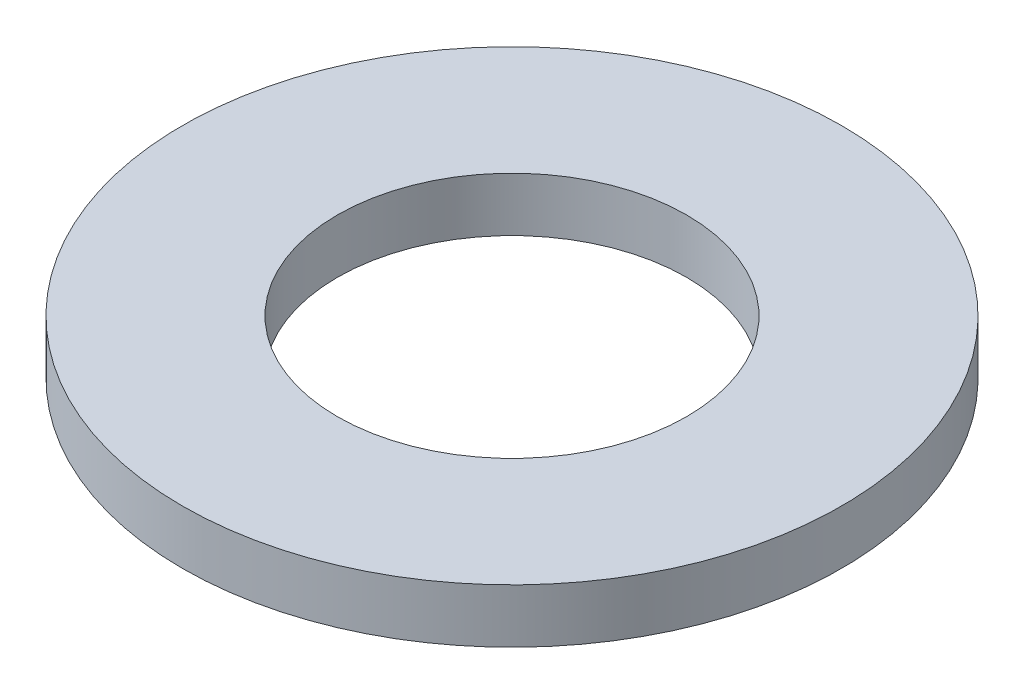
ISO-10303-21;
HEADER;
FILE_DESCRIPTION(('STEP AP214'),'2;1');
FILE_NAME('part.step','',(''),(''),'','','');
FILE_SCHEMA(('AUTOMOTIVE_DESIGN { 1 0 10303 214 1 1 1 1 }'));
ENDSEC;
DATA;
#1=APPLICATION_CONTEXT('core data for automotive mechanical design processes');
#2=APPLICATION_PROTOCOL_DEFINITION('international standard','automotive_design',2000,#1);
#3=PRODUCT_CONTEXT('',#1,'mechanical');
#4=PRODUCT('Part','Part','',(#3));
#5=PRODUCT_RELATED_PRODUCT_CATEGORY('part','',(#4));
#6=PRODUCT_DEFINITION_FORMATION('','',#4);
#7=PRODUCT_DEFINITION_CONTEXT('part definition',#1,'design');
#8=PRODUCT_DEFINITION('design','',#6,#7);
#9=PRODUCT_DEFINITION_SHAPE('','',#8);
#10=(LENGTH_UNIT() NAMED_UNIT(*) SI_UNIT(.MILLI.,.METRE.));
#11=(NAMED_UNIT(*) PLANE_ANGLE_UNIT() SI_UNIT($,.RADIAN.));
#12=(NAMED_UNIT(*) SI_UNIT($,.STERADIAN.) SOLID_ANGLE_UNIT());
#13=UNCERTAINTY_MEASURE_WITH_UNIT(LENGTH_MEASURE(1.E-05),#10,'distance_accuracy_value','');
#14=(GEOMETRIC_REPRESENTATION_CONTEXT(3) GLOBAL_UNCERTAINTY_ASSIGNED_CONTEXT((#13)) GLOBAL_UNIT_ASSIGNED_CONTEXT((#10,
#11,#12)) REPRESENTATION_CONTEXT('',''));
#15=CARTESIAN_POINT('',(0.,0.,0.));
#16=DIRECTION('',(0.,0.,1.));
#17=DIRECTION('',(1.,0.,0.));
#18=AXIS2_PLACEMENT_3D('',#15,#16,#17);
#19=CARTESIAN_POINT('',(0.,1.0414,0.));
#20=DIRECTION('',(0.,-1.,0.));
#21=DIRECTION('',(0.,0.,-1.));
#22=AXIS2_PLACEMENT_3D('',#19,#20,#21);
#23=CYLINDRICAL_SURFACE('',#22,6.35);
#24=CARTESIAN_POINT('',(0.,1.0414,0.));
#25=DIRECTION('',(0.,1.,0.));
#26=DIRECTION('',(0.,0.,1.));
#27=AXIS2_PLACEMENT_3D('',#24,#25,#26);
#28=CIRCLE('',#27,6.35);
#29=CARTESIAN_POINT('',(0.,1.0414,6.35));
#30=VERTEX_POINT('',#29);
#31=EDGE_CURVE('E10',#30,#30,#28,.T.);
#32=ORIENTED_EDGE('',*,*,#31,.F.);
#33=EDGE_LOOP('',(#32));
#34=FACE_BOUND('',#33,.T.);
#35=CARTESIAN_POINT('',(0.,0.,0.));
#36=DIRECTION('',(0.,1.,0.));
#37=DIRECTION('',(0.,0.,1.));
#38=AXIS2_PLACEMENT_3D('',#35,#36,#37);
#39=CIRCLE('',#38,6.35);
#40=CARTESIAN_POINT('',(0.,0.,6.35));
#41=VERTEX_POINT('',#40);
#42=EDGE_CURVE('E33',#41,#41,#39,.T.);
#43=ORIENTED_EDGE('',*,*,#42,.T.);
#44=EDGE_LOOP('',(#43));
#45=FACE_BOUND('',#44,.T.);
#46=ADVANCED_FACE('F30',(#34,#45),#23,.T.);
#47=CARTESIAN_POINT('',(0.,1.0414,0.));
#48=DIRECTION('',(0.,1.,0.));
#49=DIRECTION('',(0.,0.,1.));
#50=AXIS2_PLACEMENT_3D('',#47,#48,#49);
#51=PLANE('',#50);
#52=CARTESIAN_POINT('',(0.,1.0414,0.));
#53=DIRECTION('',(0.,1.,0.));
#54=DIRECTION('',(0.,0.,1.));
#55=AXIS2_PLACEMENT_3D('',#52,#53,#54);
#56=CIRCLE('',#55,3.3655);
#57=CARTESIAN_POINT('',(0.,1.0414,3.3655));
#58=VERTEX_POINT('',#57);
#59=EDGE_CURVE('E42',#58,#58,#56,.T.);
#60=ORIENTED_EDGE('',*,*,#59,.F.);
#61=EDGE_LOOP('',(#60));
#62=FACE_BOUND('',#61,.T.);
#63=ORIENTED_EDGE('',*,*,#31,.T.);
#64=EDGE_LOOP('',(#63));
#65=FACE_BOUND('',#64,.T.);
#66=ADVANCED_FACE('F57',(#62,#65),#51,.T.);
#67=CARTESIAN_POINT('',(0.,0.,0.));
#68=DIRECTION('',(0.,1.,0.));
#69=DIRECTION('',(0.,0.,1.));
#70=AXIS2_PLACEMENT_3D('',#67,#68,#69);
#71=PLANE('',#70);
#72=CARTESIAN_POINT('',(0.,0.,0.));
#73=DIRECTION('',(0.,1.,0.));
#74=DIRECTION('',(0.,0.,1.));
#75=AXIS2_PLACEMENT_3D('',#72,#73,#74);
#76=CIRCLE('',#75,3.3655);
#77=CARTESIAN_POINT('',(0.,0.,3.3655));
#78=VERTEX_POINT('',#77);
#79=EDGE_CURVE('E40',#78,#78,#76,.T.);
#80=ORIENTED_EDGE('',*,*,#79,.T.);
#81=EDGE_LOOP('',(#80));
#82=FACE_BOUND('',#81,.T.);
#83=ORIENTED_EDGE('',*,*,#42,.F.);
#84=EDGE_LOOP('',(#83));
#85=FACE_BOUND('',#84,.T.);
#86=ADVANCED_FACE('F48',(#82,#85),#71,.F.);
#87=CARTESIAN_POINT('',(0.,0.,0.));
#88=DIRECTION('',(0.,1.,0.));
#89=DIRECTION('',(0.,0.,1.));
#90=AXIS2_PLACEMENT_3D('',#87,#88,#89);
#91=CYLINDRICAL_SURFACE('',#90,3.3655);
#92=ORIENTED_EDGE('',*,*,#79,.F.);
#93=EDGE_LOOP('',(#92));
#94=FACE_BOUND('',#93,.T.);
#95=ORIENTED_EDGE('',*,*,#59,.T.);
#96=EDGE_LOOP('',(#95));
#97=FACE_BOUND('',#96,.T.);
#98=ADVANCED_FACE('F51',(#94,#97),#91,.F.);
#99=CLOSED_SHELL('',(#46,#66,#86,#98));
#100=MANIFOLD_SOLID_BREP('B2',#99);
#101=ADVANCED_BREP_SHAPE_REPRESENTATION('',(#18,#100),#14);
#102=SHAPE_DEFINITION_REPRESENTATION(#9,#101);
ENDSEC;
END-ISO-10303-21;
